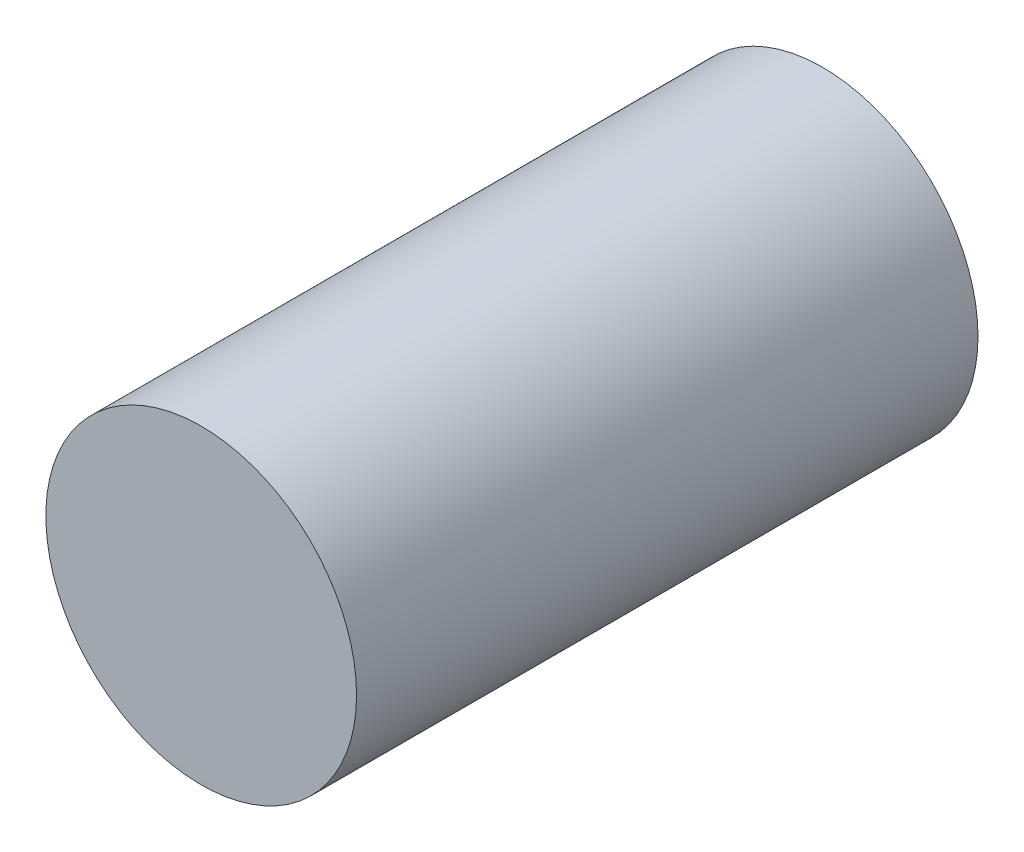
ISO-10303-21;
HEADER;
FILE_DESCRIPTION(('STEP AP214'),'2;1');
FILE_NAME('part.step','',(''),(''),'','','');
FILE_SCHEMA(('AUTOMOTIVE_DESIGN { 1 0 10303 214 1 1 1 1 }'));
ENDSEC;
DATA;
#1=APPLICATION_CONTEXT('core data for automotive mechanical design processes');
#2=APPLICATION_PROTOCOL_DEFINITION('international standard','automotive_design',2000,#1);
#3=PRODUCT_CONTEXT('',#1,'mechanical');
#4=PRODUCT('Part','Part','',(#3));
#5=PRODUCT_RELATED_PRODUCT_CATEGORY('part','',(#4));
#6=PRODUCT_DEFINITION_FORMATION('','',#4);
#7=PRODUCT_DEFINITION_CONTEXT('part definition',#1,'design');
#8=PRODUCT_DEFINITION('design','',#6,#7);
#9=PRODUCT_DEFINITION_SHAPE('','',#8);
#10=(LENGTH_UNIT() NAMED_UNIT(*) SI_UNIT(.MILLI.,.METRE.));
#11=(NAMED_UNIT(*) PLANE_ANGLE_UNIT() SI_UNIT($,.RADIAN.));
#12=(NAMED_UNIT(*) SI_UNIT($,.STERADIAN.) SOLID_ANGLE_UNIT());
#13=UNCERTAINTY_MEASURE_WITH_UNIT(LENGTH_MEASURE(1.E-05),#10,'distance_accuracy_value','');
#14=(GEOMETRIC_REPRESENTATION_CONTEXT(3) GLOBAL_UNCERTAINTY_ASSIGNED_CONTEXT((#13)) GLOBAL_UNIT_ASSIGNED_CONTEXT((#10,
#11,#12)) REPRESENTATION_CONTEXT('',''));
#15=CARTESIAN_POINT('',(0.,0.,0.));
#16=DIRECTION('',(0.,0.,1.));
#17=DIRECTION('',(1.,0.,0.));
#18=AXIS2_PLACEMENT_3D('',#15,#16,#17);
#19=CARTESIAN_POINT('',(0.,0.,0.));
#20=DIRECTION('',(0.,0.,1.));
#21=DIRECTION('',(1.,0.,0.));
#22=AXIS2_PLACEMENT_3D('',#19,#20,#21);
#23=PLANE('',#22);
#24=CARTESIAN_POINT('',(0.,0.,0.));
#25=DIRECTION('',(0.,0.,1.));
#26=DIRECTION('',(1.,0.,0.));
#27=AXIS2_PLACEMENT_3D('',#24,#25,#26);
#28=CIRCLE('',#27,10.);
#29=CARTESIAN_POINT('',(10.,0.,0.));
#30=VERTEX_POINT('',#29);
#31=EDGE_CURVE('E36',#30,#30,#28,.T.);
#32=ORIENTED_EDGE('',*,*,#31,.F.);
#33=EDGE_LOOP('',(#32));
#34=FACE_BOUND('',#33,.T.);
#35=CARTESIAN_POINT('',(0.,0.,0.));
#36=DIRECTION('',(0.,0.,-1.));
#37=DIRECTION('',(-1.,0.,0.));
#38=AXIS2_PLACEMENT_3D('',#35,#36,#37);
#39=CIRCLE('',#38,2.1);
#40=CARTESIAN_POINT('',(-2.1,0.,0.));
#41=VERTEX_POINT('',#40);
#42=EDGE_CURVE('E122',#41,#41,#39,.T.);
#43=ORIENTED_EDGE('',*,*,#42,.F.);
#44=EDGE_LOOP('',(#43));
#45=FACE_BOUND('',#44,.T.);
#46=ADVANCED_FACE('F32',(#34,#45),#23,.F.);
#47=CARTESIAN_POINT('',(0.,0.,40.));
#48=DIRECTION('',(0.,0.,-1.));
#49=DIRECTION('',(-1.,0.,0.));
#50=AXIS2_PLACEMENT_3D('',#47,#48,#49);
#51=CYLINDRICAL_SURFACE('',#50,10.);
#52=CARTESIAN_POINT('',(0.,0.,40.));
#53=DIRECTION('',(0.,0.,1.));
#54=DIRECTION('',(1.,0.,0.));
#55=AXIS2_PLACEMENT_3D('',#52,#53,#54);
#56=CIRCLE('',#55,10.);
#57=CARTESIAN_POINT('',(10.,0.,40.));
#58=VERTEX_POINT('',#57);
#59=EDGE_CURVE('E10',#58,#58,#56,.T.);
#60=ORIENTED_EDGE('',*,*,#59,.F.);
#61=EDGE_LOOP('',(#60));
#62=FACE_BOUND('',#61,.T.);
#63=ORIENTED_EDGE('',*,*,#31,.T.);
#64=EDGE_LOOP('',(#63));
#65=FACE_BOUND('',#64,.T.);
#66=ADVANCED_FACE('F34',(#62,#65),#51,.T.);
#67=CARTESIAN_POINT('',(0.,0.,40.));
#68=DIRECTION('',(0.,0.,1.));
#69=DIRECTION('',(1.,0.,0.));
#70=AXIS2_PLACEMENT_3D('',#67,#68,#69);
#71=PLANE('',#70);
#72=ORIENTED_EDGE('',*,*,#59,.T.);
#73=EDGE_LOOP('',(#72));
#74=FACE_BOUND('',#73,.T.);
#75=ADVANCED_FACE('F149',(#74),#71,.T.);
#76=CARTESIAN_POINT('',(0.,0.,20.));
#77=DIRECTION('',(0.,0.,-1.));
#78=DIRECTION('',(1.,0.,0.));
#79=AXIS2_PLACEMENT_3D('',#76,#77,#78);
#80=SPHERICAL_SURFACE('',#79,1.);
#81=CARTESIAN_POINT('',(0.,0.,20.));
#82=DIRECTION('',(0.,0.,-1.));
#83=DIRECTION('',(-1.,0.,0.));
#84=AXIS2_PLACEMENT_3D('',#81,#82,#83);
#85=CIRCLE('',#84,1.);
#86=CARTESIAN_POINT('',(-0.999999999999998,0.,20.));
#87=VERTEX_POINT('',#86);
#88=EDGE_CURVE('E195',#87,#87,#85,.T.);
#89=ORIENTED_EDGE('',*,*,#88,.T.);
#90=EDGE_LOOP('',(#89));
#91=FACE_BOUND('',#90,.T.);
#92=ADVANCED_FACE('F156',(#91),#80,.F.);
#93=CARTESIAN_POINT('',(1.,0.,20.));
#94=DIRECTION('',(0.,0.,-1.));
#95=DIRECTION('',(-1.,0.,0.));
#96=AXIS2_PLACEMENT_3D('',#93,#94,#95);
#97=PLANE('',#96);
#98=CARTESIAN_POINT('',(0.,0.,20.));
#99=DIRECTION('',(0.,0.,-1.));
#100=DIRECTION('',(-1.,0.,0.));
#101=AXIS2_PLACEMENT_3D('',#98,#99,#100);
#102=CIRCLE('',#101,1.6);
#103=CARTESIAN_POINT('',(-1.59999999999999,0.,20.));
#104=VERTEX_POINT('',#103);
#105=EDGE_CURVE('E194',#104,#104,#102,.T.);
#106=ORIENTED_EDGE('',*,*,#105,.T.);
#107=EDGE_LOOP('',(#106));
#108=FACE_BOUND('',#107,.T.);
#109=ORIENTED_EDGE('',*,*,#88,.F.);
#110=EDGE_LOOP('',(#109));
#111=FACE_BOUND('',#110,.T.);
#112=ADVANCED_FACE('F180',(#108,#111),#97,.T.);
#113=CARTESIAN_POINT('',(0.,0.,19.5));
#114=DIRECTION('',(0.,0.,-1.));
#115=DIRECTION('',(-1.,0.,0.));
#116=AXIS2_PLACEMENT_3D('',#113,#114,#115);
#117=TOROIDAL_SURFACE('',#116,1.6,0.5);
#118=CARTESIAN_POINT('',(0.,0.,19.5));
#119=DIRECTION('',(0.,0.,-1.));
#120=DIRECTION('',(-1.,0.,0.));
#121=AXIS2_PLACEMENT_3D('',#118,#119,#120);
#122=CIRCLE('',#121,2.1);
#123=CARTESIAN_POINT('',(-2.1,0.,19.5));
#124=VERTEX_POINT('',#123);
#125=EDGE_CURVE('E191',#124,#124,#122,.T.);
#126=ORIENTED_EDGE('',*,*,#125,.T.);
#127=EDGE_LOOP('',(#126));
#128=FACE_BOUND('',#127,.T.);
#129=ORIENTED_EDGE('',*,*,#105,.F.);
#130=EDGE_LOOP('',(#129));
#131=FACE_BOUND('',#130,.T.);
#132=ADVANCED_FACE('F140',(#128,#131),#117,.F.);
#133=CARTESIAN_POINT('',(0.,0.,0.));
#134=DIRECTION('',(0.,0.,-1.));
#135=DIRECTION('',(-1.,0.,0.));
#136=AXIS2_PLACEMENT_3D('',#133,#134,#135);
#137=CYLINDRICAL_SURFACE('',#136,2.1);
#138=CARTESIAN_POINT('',(2.1,0.,17.3649147038914));
#139=CARTESIAN_POINT('',(2.10000013534698,0.027017055860878,17.3649149600796));
#140=CARTESIAN_POINT('',(2.09947389495133,0.0540321101324284,17.362682637695));
#141=CARTESIAN_POINT('',(2.09742685160139,0.107287831584696,17.3538120437736));
#142=CARTESIAN_POINT('',(2.09590615334828,0.133528579984023,17.3471742360659));
#143=CARTESIAN_POINT('',(2.09203682808871,0.18448648880531,17.3296707766783));
#144=CARTESIAN_POINT('',(2.08968840637529,0.209204025232012,17.3188061732644));
#145=CARTESIAN_POINT('',(2.08441949205406,0.256438812860924,17.2931500051854));
#146=CARTESIAN_POINT('',(2.08149901159444,0.278956110771981,17.2783585239087));
#147=CARTESIAN_POINT('',(2.07537781948196,0.321356347266309,17.2451572676696));
#148=CARTESIAN_POINT('',(2.07217527613835,0.341219579433089,17.2267227015647));
#149=CARTESIAN_POINT('',(2.06584358018548,0.377668413517448,17.1868532793931));
#150=CARTESIAN_POINT('',(2.06271443313305,0.394253767968702,17.1654181970081));
#151=CARTESIAN_POINT('',(2.05673250454513,0.424377571104567,17.1193856937886));
#152=CARTESIAN_POINT('',(2.05389315252176,0.437789710924929,17.0947041064263));
#153=CARTESIAN_POINT('',(2.04888139395525,0.460676216341718,17.0435213855989));
#154=CARTESIAN_POINT('',(2.04670919882964,0.470149334024382,17.0170196785989));
#155=CARTESIAN_POINT('',(2.04305273215899,0.485804566358775,16.9606876323107));
#156=CARTESIAN_POINT('',(2.04163857678029,0.4916572949395,16.9307616842427));
#157=CARTESIAN_POINT('',(2.03985887629031,0.498988222050614,16.8703556441127));
#158=CARTESIAN_POINT('',(2.0394937643768,0.500464613400256,16.839875328354));
#159=CARTESIAN_POINT('',(2.03980213630231,0.499207905300174,16.7751434615067));
#160=CARTESIAN_POINT('',(2.04061309280366,0.495917675978645,16.7409034671232));
#161=CARTESIAN_POINT('',(2.0433749395959,0.484409692666076,16.6732919406647));
#162=CARTESIAN_POINT('',(2.04532693848286,0.476187146408207,16.6399212861905));
#163=CARTESIAN_POINT('',(2.05042096887334,0.453786505557304,16.5708804944482));
#164=CARTESIAN_POINT('',(2.05367699960968,0.439015988017871,16.5354094953734));
#165=CARTESIAN_POINT('',(2.06089886995536,0.403756472101969,16.4674983715523));
#166=CARTESIAN_POINT('',(2.06486431716248,0.38327063157673,16.4350565862673));
#167=CARTESIAN_POINT('',(2.07206297401813,0.341892415598979,16.381339196235));
#168=CARTESIAN_POINT('',(2.0752606449846,0.322124407818162,16.3591920737752));
#169=CARTESIAN_POINT('',(2.08146131694597,0.279259443097242,16.3183635594364));
#170=CARTESIAN_POINT('',(2.08446461777478,0.256167799619371,16.299676742612));
#171=CARTESIAN_POINT('',(2.08940704680269,0.21161201198237,16.2699426125728));
#172=CARTESIAN_POINT('',(2.09143987391839,0.1906789564952,16.2581179004268));
#173=CARTESIAN_POINT('',(2.0949544273795,0.147112038001286,16.2380376588472));
#174=CARTESIAN_POINT('',(2.09643651016618,0.124479286479745,16.2297798203719));
#175=CARTESIAN_POINT('',(2.09868433436348,0.0779092196004517,16.2173616516538));
#176=CARTESIAN_POINT('',(2.09944545237326,0.053964512305816,16.2132277585759));
#177=CARTESIAN_POINT('',(2.10013055186416,0.00571283440946134,16.2095033670869));
#178=CARTESIAN_POINT('',(2.10005487599663,-0.0185939838431242,16.2099110090032));
#179=CARTESIAN_POINT('',(2.09913048565165,-0.0641599620608657,16.2149447287968));
#180=CARTESIAN_POINT('',(2.09836341877521,-0.085472066102778,16.2191253176157));
#181=CARTESIAN_POINT('',(2.09625237617656,-0.127126929428396,16.2308085790678));
#182=CARTESIAN_POINT('',(2.09490832730107,-0.147469565433565,16.2383116729522));
#183=CARTESIAN_POINT('',(2.09170109037234,-0.187645926044247,16.256615365473));
#184=CARTESIAN_POINT('',(2.08981769869844,-0.207418083878495,16.267546288707));
#185=CARTESIAN_POINT('',(2.0857221477503,-0.245204266217452,16.2920555196805));
#186=CARTESIAN_POINT('',(2.08350974740615,-0.263216985383095,16.3056357709197));
#187=CARTESIAN_POINT('',(2.07784741190989,-0.305264170745397,16.3417717880896));
#188=CARTESIAN_POINT('',(2.07429909016047,-0.32822110846253,16.3655706029834));
#189=CARTESIAN_POINT('',(2.06726634480154,-0.369944883708084,16.4166038751656));
#190=CARTESIAN_POINT('',(2.06378203243842,-0.388704962517841,16.4438437652384));
#191=CARTESIAN_POINT('',(2.05718999426136,-0.422214024555051,16.5012290293635));
#192=CARTESIAN_POINT('',(2.05408811941643,-0.436904172795394,16.5314092683357));
#193=CARTESIAN_POINT('',(2.04862380073637,-0.461847686310285,16.5936016354477));
#194=CARTESIAN_POINT('',(2.04626134933996,-0.472101096954905,16.625613744851));
#195=CARTESIAN_POINT('',(2.04223391007568,-0.489256651354704,16.6959592864633));
#196=CARTESIAN_POINT('',(2.04073664696461,-0.495379951350422,16.734496123406));
#197=CARTESIAN_POINT('',(2.03935724630288,-0.501030518456208,16.8121113960749));
#198=CARTESIAN_POINT('',(2.03947551094671,-0.500556143038292,16.851189964249));
#199=CARTESIAN_POINT('',(2.04140263620674,-0.492637464185853,16.9272154609909));
#200=CARTESIAN_POINT('',(2.04315119144443,-0.485441768872913,16.9641887606865));
#201=CARTESIAN_POINT('',(2.04810935822317,-0.464077651127189,17.0359599772734));
#202=CARTESIAN_POINT('',(2.05131703919534,-0.449918440117606,17.0707606997278));
#203=CARTESIAN_POINT('',(2.05821647195102,-0.417111902889266,17.1319618207609));
#204=CARTESIAN_POINT('',(2.0617791558553,-0.399360809433088,17.1588576582524));
#205=CARTESIAN_POINT('',(2.06917746723406,-0.359056879331325,17.2087312468116));
#206=CARTESIAN_POINT('',(2.07301289316437,-0.336507564305008,17.231711849283));
#207=CARTESIAN_POINT('',(2.07998659418494,-0.290073077223846,17.2704852754232));
#208=CARTESIAN_POINT('',(2.08315478044131,-0.266622656068281,17.28679558492));
#209=CARTESIAN_POINT('',(2.08888978435223,-0.217158441562158,17.3150546143603));
#210=CARTESIAN_POINT('',(2.09145673714156,-0.191145226102805,17.3270043147432));
#211=CARTESIAN_POINT('',(2.09562605959526,-0.138002269492191,17.3459414886457));
#212=CARTESIAN_POINT('',(2.09724990625089,-0.110913763757642,17.3530401584525));
#213=CARTESIAN_POINT('',(2.09943675443007,-0.0558827357357489,17.3625264025123));
#214=CARTESIAN_POINT('',(2.09999986002788,-0.0279402975051125,17.3649144389486));
#215=CARTESIAN_POINT('',(2.1,0.,17.3649147038914));
#216=B_SPLINE_CURVE_WITH_KNOTS('',3,(#138,#139,#140,#141,#142,#143,#144,#145,#146,#147,#148,
#149,#150,#151,#152,#153,#154,#155,#156,#157,#158,#159,#160,#161,#162,#163,#164,#165,#166,#167,
#168,#169,#170,#171,#172,#173,#174,#175,#176,#177,#178,#179,#180,#181,#182,#183,#184,#185,#186,
#187,#188,#189,#190,#191,#192,#193,#194,#195,#196,#197,#198,#199,#200,#201,#202,#203,#204,#205,
#206,#207,#208,#209,#210,#211,#212,#213,#214,#215),.UNSPECIFIED.,.T.,.F.,(4,2,2,2,2,2,2,2,2,2,2,
2,2,2,2,2,2,2,2,2,2,2,2,2,2,2,2,2,2,2,2,2,2,2,2,2,2,2,4),(0.,0.0809513147617396,
0.161894107962196,0.242816839736661,0.323737853229647,0.405229771528625,0.486727839785084,
0.571065745582884,0.65543034998486,0.746640052437058,0.8378874141149,0.940697549231841,
1.04360773741856,1.15876815470816,1.27386506872745,1.36311542747417,1.45222465555411,
1.52431978495742,1.59636817284893,1.66887552542984,1.74135318871533,1.80625338360562,
1.87116180936932,1.93892030973858,2.00672870472029,2.10595927272778,2.20534851162708,
2.30610732916013,2.40686511630929,2.52344124026564,2.64004638701576,2.75250243039194,
2.86481011405142,2.96152283588183,3.05816481945481,3.14394850071505,3.22971288247062,
3.31343872510083,3.39715635257008),.UNSPECIFIED.);
#217=CARTESIAN_POINT('',(2.1,0.,17.3649147038914));
#218=VERTEX_POINT('',#217);
#219=EDGE_CURVE('E63',#218,#218,#216,.T.);
#220=ORIENTED_EDGE('',*,*,#219,.F.);
#221=EDGE_LOOP('',(#220));
#222=FACE_BOUND('',#221,.T.);
#223=CARTESIAN_POINT('',(0.,-2.1,17.3649147038915));
#224=CARTESIAN_POINT('',(0.0270170558608727,-2.10000013534698,17.3649149600796));
#225=CARTESIAN_POINT('',(0.0540321101324228,-2.09947389495133,17.362682637695));
#226=CARTESIAN_POINT('',(0.10728783158469,-2.09742685160139,17.3538120437736));
#227=CARTESIAN_POINT('',(0.133528579984018,-2.09590615334828,17.3471742360659));
#228=CARTESIAN_POINT('',(0.184486488805306,-2.09203682808871,17.3296707766783));
#229=CARTESIAN_POINT('',(0.209204025232009,-2.08968840637528,17.3188061732644));
#230=CARTESIAN_POINT('',(0.256438812860921,-2.08441949205406,17.2931500051854));
#231=CARTESIAN_POINT('',(0.278956110771977,-2.08149901159444,17.2783585239087));
#232=CARTESIAN_POINT('',(0.321356347266305,-2.07537781948196,17.2451572676696));
#233=CARTESIAN_POINT('',(0.341219579433084,-2.07217527613834,17.2267227015647));
#234=CARTESIAN_POINT('',(0.377668413517443,-2.06584358018548,17.186853279393));
#235=CARTESIAN_POINT('',(0.394253767968698,-2.06271443313305,17.1654181970081));
#236=CARTESIAN_POINT('',(0.424377571104564,-2.05673250454513,17.1193856937886));
#237=CARTESIAN_POINT('',(0.437789710924925,-2.05389315252176,17.0947041064263));
#238=CARTESIAN_POINT('',(0.460676216341713,-2.04888139395525,17.0435213855989));
#239=CARTESIAN_POINT('',(0.470149334024377,-2.04670919882964,17.0170196785989));
#240=CARTESIAN_POINT('',(0.48580456635877,-2.04305273215899,16.9606876323107));
#241=CARTESIAN_POINT('',(0.491657294939495,-2.04163857678029,16.9307616842427));
#242=CARTESIAN_POINT('',(0.498988222050609,-2.03985887629031,16.8703556441127));
#243=CARTESIAN_POINT('',(0.500464613400251,-2.0394937643768,16.839875328354));
#244=CARTESIAN_POINT('',(0.499207905300169,-2.03980213630231,16.7751434615067));
#245=CARTESIAN_POINT('',(0.495917675978639,-2.04061309280366,16.7409034671232));
#246=CARTESIAN_POINT('',(0.48440969266607,-2.0433749395959,16.6732919406647));
#247=CARTESIAN_POINT('',(0.476187146408202,-2.04532693848286,16.6399212861905));
#248=CARTESIAN_POINT('',(0.453786505557298,-2.05042096887334,16.5708804944482));
#249=CARTESIAN_POINT('',(0.439015988017866,-2.05367699960968,16.5354094953734));
#250=CARTESIAN_POINT('',(0.403756472101964,-2.06089886995536,16.4674983715523));
#251=CARTESIAN_POINT('',(0.383270631576725,-2.06486431716248,16.4350565862673));
#252=CARTESIAN_POINT('',(0.341892415598975,-2.07206297401812,16.381339196235));
#253=CARTESIAN_POINT('',(0.322124407818159,-2.0752606449846,16.3591920737752));
#254=CARTESIAN_POINT('',(0.279259443097241,-2.08146131694597,16.3183635594364));
#255=CARTESIAN_POINT('',(0.25616779961937,-2.08446461777478,16.299676742612));
#256=CARTESIAN_POINT('',(0.211612011982369,-2.08940704680268,16.2699426125728));
#257=CARTESIAN_POINT('',(0.1906789564952,-2.09143987391839,16.2581179004268));
#258=CARTESIAN_POINT('',(0.147112038001287,-2.09495442737949,16.2380376588472));
#259=CARTESIAN_POINT('',(0.124479286479746,-2.09643651016618,16.2297798203719));
#260=CARTESIAN_POINT('',(0.0779092196004533,-2.09868433436348,16.2173616516538));
#261=CARTESIAN_POINT('',(0.0539645123058175,-2.09944545237325,16.2132277585759));
#262=CARTESIAN_POINT('',(0.00571283440946252,-2.10013055186416,16.2095033670869));
#263=CARTESIAN_POINT('',(-0.0185939838431233,-2.10005487599662,16.2099110090032));
#264=CARTESIAN_POINT('',(-0.0641599620608655,-2.09913048565165,16.2149447287968));
#265=CARTESIAN_POINT('',(-0.0854720661027782,-2.09836341877521,16.2191253176157));
#266=CARTESIAN_POINT('',(-0.127126929428396,-2.09625237617656,16.2308085790678));
#267=CARTESIAN_POINT('',(-0.147469565433565,-2.09490832730106,16.2383116729522));
#268=CARTESIAN_POINT('',(-0.187645926044247,-2.09170109037234,16.256615365473));
#269=CARTESIAN_POINT('',(-0.207418083878496,-2.08981769869844,16.267546288707));
#270=CARTESIAN_POINT('',(-0.245204266217453,-2.0857221477503,16.2920555196805));
#271=CARTESIAN_POINT('',(-0.263216985383096,-2.08350974740615,16.3056357709197));
#272=CARTESIAN_POINT('',(-0.305264170745399,-2.07784741190989,16.3417717880896));
#273=CARTESIAN_POINT('',(-0.328221108462533,-2.07429909016047,16.3655706029834));
#274=CARTESIAN_POINT('',(-0.369944883708088,-2.06726634480154,16.4166038751656));
#275=CARTESIAN_POINT('',(-0.388704962517844,-2.06378203243842,16.4438437652384));
#276=CARTESIAN_POINT('',(-0.422214024555054,-2.05718999426136,16.5012290293635));
#277=CARTESIAN_POINT('',(-0.436904172795397,-2.05408811941643,16.5314092683357));
#278=CARTESIAN_POINT('',(-0.461847686310288,-2.04862380073636,16.5936016354477));
#279=CARTESIAN_POINT('',(-0.472101096954908,-2.04626134933996,16.625613744851));
#280=CARTESIAN_POINT('',(-0.489256651354708,-2.04223391007567,16.6959592864633));
#281=CARTESIAN_POINT('',(-0.495379951350426,-2.0407366469646,16.734496123406));
#282=CARTESIAN_POINT('',(-0.501030518456213,-2.03935724630288,16.8121113960749));
#283=CARTESIAN_POINT('',(-0.500556143038297,-2.03947551094671,16.851189964249));
#284=CARTESIAN_POINT('',(-0.492637464185859,-2.04140263620674,16.9272154609909));
#285=CARTESIAN_POINT('',(-0.48544176887292,-2.04315119144442,16.9641887606865));
#286=CARTESIAN_POINT('',(-0.464077651127197,-2.04810935822316,17.0359599772734));
#287=CARTESIAN_POINT('',(-0.449918440117614,-2.05131703919534,17.0707606997278));
#288=CARTESIAN_POINT('',(-0.417111902889275,-2.05821647195102,17.1319618207609));
#289=CARTESIAN_POINT('',(-0.399360809433098,-2.06177915585529,17.1588576582524));
#290=CARTESIAN_POINT('',(-0.359056879331336,-2.06917746723405,17.2087312468116));
#291=CARTESIAN_POINT('',(-0.336507564305019,-2.07301289316437,17.231711849283));
#292=CARTESIAN_POINT('',(-0.290073077223858,-2.07998659418494,17.2704852754232));
#293=CARTESIAN_POINT('',(-0.266622656068293,-2.08315478044131,17.28679558492));
#294=CARTESIAN_POINT('',(-0.217158441562169,-2.08888978435222,17.3150546143603));
#295=CARTESIAN_POINT('',(-0.191145226102815,-2.09145673714156,17.3270043147432));
#296=CARTESIAN_POINT('',(-0.1380022694922,-2.09562605959526,17.3459414886457));
#297=CARTESIAN_POINT('',(-0.11091376375765,-2.09724990625089,17.3530401584525));
#298=CARTESIAN_POINT('',(-0.0558827357357555,-2.09943675443007,17.3625264025123));
#299=CARTESIAN_POINT('',(-0.0279402975051184,-2.09999986002787,17.3649144389487));
#300=CARTESIAN_POINT('',(0.,-2.1,17.3649147038915));
#301=B_SPLINE_CURVE_WITH_KNOTS('',3,(#223,#224,#225,#226,#227,#228,#229,#230,#231,#232,#233,
#234,#235,#236,#237,#238,#239,#240,#241,#242,#243,#244,#245,#246,#247,#248,#249,#250,#251,#252,
#253,#254,#255,#256,#257,#258,#259,#260,#261,#262,#263,#264,#265,#266,#267,#268,#269,#270,#271,
#272,#273,#274,#275,#276,#277,#278,#279,#280,#281,#282,#283,#284,#285,#286,#287,#288,#289,#290,
#291,#292,#293,#294,#295,#296,#297,#298,#299,#300),.UNSPECIFIED.,.T.,.F.,(4,2,2,2,2,2,2,2,2,2,2,
2,2,2,2,2,2,2,2,2,2,2,2,2,2,2,2,2,2,2,2,2,2,2,2,2,2,2,4),(0.,0.0809513147617394,
0.161894107962197,0.242816839736665,0.323737853229649,0.405229771528627,0.486727839785087,
0.571065745582887,0.655430349984859,0.746640052437057,0.837887414114898,0.94069754923184,
1.04360773741857,1.15876815470816,1.27386506872745,1.36311542747416,1.4522246555541,
1.52431978495741,1.59636817284892,1.66887552542983,1.74135318871532,1.80625338360562,
1.87116180936932,1.93892030973858,2.00672870472029,2.10595927272778,2.20534851162707,
2.30610732916012,2.40686511630928,2.52344124026564,2.64004638701575,2.75250243039193,
2.86481011405141,2.96152283588183,3.0581648194548,3.14394850071504,3.22971288247061,
3.31343872510082,3.39715635257008),.UNSPECIFIED.);
#302=CARTESIAN_POINT('',(0.,-2.1,17.3649147038915));
#303=VERTEX_POINT('',#302);
#304=EDGE_CURVE('E70',#303,#303,#301,.T.);
#305=ORIENTED_EDGE('',*,*,#304,.F.);
#306=EDGE_LOOP('',(#305));
#307=FACE_BOUND('',#306,.T.);
#308=CARTESIAN_POINT('',(-2.1,0.,17.3649147038915));
#309=CARTESIAN_POINT('',(-2.10000013534698,-0.0270170558608539,17.3649149600796));
#310=CARTESIAN_POINT('',(-2.09947389495132,-0.0540321101324041,17.362682637695));
#311=CARTESIAN_POINT('',(-2.09742685160139,-0.107287831584672,17.3538120437736));
#312=CARTESIAN_POINT('',(-2.09590615334828,-0.133528579983999,17.3471742360659));
#313=CARTESIAN_POINT('',(-2.09203682808871,-0.184486488805287,17.3296707766783));
#314=CARTESIAN_POINT('',(-2.08968840637528,-0.20920402523199,17.3188061732644));
#315=CARTESIAN_POINT('',(-2.08441949205406,-0.256438812860902,17.2931500051854));
#316=CARTESIAN_POINT('',(-2.08149901159444,-0.278956110771958,17.2783585239087));
#317=CARTESIAN_POINT('',(-2.07537781948196,-0.321356347266287,17.2451572676696));
#318=CARTESIAN_POINT('',(-2.07217527613834,-0.341219579433068,17.2267227015647));
#319=CARTESIAN_POINT('',(-2.06584358018548,-0.377668413517428,17.1868532793931));
#320=CARTESIAN_POINT('',(-2.06271443313305,-0.394253767968682,17.1654181970081));
#321=CARTESIAN_POINT('',(-2.05673250454513,-0.424377571104548,17.1193856937886));
#322=CARTESIAN_POINT('',(-2.05389315252176,-0.43778971092491,17.0947041064263));
#323=CARTESIAN_POINT('',(-2.04888139395525,-0.4606762163417,17.0435213855989));
#324=CARTESIAN_POINT('',(-2.04670919882964,-0.470149334024364,17.0170196785989));
#325=CARTESIAN_POINT('',(-2.04305273215899,-0.485804566358758,16.9606876323107));
#326=CARTESIAN_POINT('',(-2.04163857678029,-0.491657294939484,16.9307616842427));
#327=CARTESIAN_POINT('',(-2.03985887629031,-0.498988222050599,16.8703556441128));
#328=CARTESIAN_POINT('',(-2.0394937643768,-0.500464613400241,16.839875328354));
#329=CARTESIAN_POINT('',(-2.03980213630231,-0.499207905300161,16.7751434615067));
#330=CARTESIAN_POINT('',(-2.04061309280366,-0.495917675978632,16.7409034671232));
#331=CARTESIAN_POINT('',(-2.0433749395959,-0.484409692666064,16.6732919406647));
#332=CARTESIAN_POINT('',(-2.04532693848286,-0.476187146408196,16.6399212861905));
#333=CARTESIAN_POINT('',(-2.05042096887334,-0.453786505557293,16.5708804944482));
#334=CARTESIAN_POINT('',(-2.05367699960968,-0.439015988017861,16.5354094953734));
#335=CARTESIAN_POINT('',(-2.06089886995535,-0.40375647210196,16.4674983715523));
#336=CARTESIAN_POINT('',(-2.06486431716247,-0.383270631576723,16.4350565862673));
#337=CARTESIAN_POINT('',(-2.07206297401812,-0.341892415598974,16.381339196235));
#338=CARTESIAN_POINT('',(-2.07526064498459,-0.322124407818158,16.3591920737752));
#339=CARTESIAN_POINT('',(-2.08146131694597,-0.279259443097239,16.3183635594364));
#340=CARTESIAN_POINT('',(-2.08446461777477,-0.256167799619368,16.299676742612));
#341=CARTESIAN_POINT('',(-2.08940704680268,-0.211612011982367,16.2699426125728));
#342=CARTESIAN_POINT('',(-2.09143987391839,-0.190678956495198,16.2581179004268));
#343=CARTESIAN_POINT('',(-2.09495442737949,-0.147112038001286,16.2380376588472));
#344=CARTESIAN_POINT('',(-2.09643651016617,-0.124479286479744,16.229779820372));
#345=CARTESIAN_POINT('',(-2.09868433436347,-0.0779092196004506,16.2173616516538));
#346=CARTESIAN_POINT('',(-2.09944545237325,-0.0539645123058151,16.2132277585759));
#347=CARTESIAN_POINT('',(-2.10013055186416,-0.00571283440946044,16.2095033670869));
#348=CARTESIAN_POINT('',(-2.10005487599662,0.0185939838431254,16.2099110090032));
#349=CARTESIAN_POINT('',(-2.09913048565164,0.0641599620608674,16.2149447287968));
#350=CARTESIAN_POINT('',(-2.09836341877521,0.0854720661027801,16.2191253176157));
#351=CARTESIAN_POINT('',(-2.09625237617656,0.127126929428398,16.2308085790678));
#352=CARTESIAN_POINT('',(-2.09490832730106,0.147469565433568,16.2383116729522));
#353=CARTESIAN_POINT('',(-2.09170109037234,0.18764592604425,16.256615365473));
#354=CARTESIAN_POINT('',(-2.08981769869844,0.207418083878499,16.267546288707));
#355=CARTESIAN_POINT('',(-2.0857221477503,0.245204266217456,16.2920555196805));
#356=CARTESIAN_POINT('',(-2.08350974740615,0.263216985383099,16.3056357709197));
#357=CARTESIAN_POINT('',(-2.07784741190988,0.305264170745401,16.3417717880896));
#358=CARTESIAN_POINT('',(-2.07429909016047,0.328221108462534,16.3655706029834));
#359=CARTESIAN_POINT('',(-2.06726634480153,0.369944883708089,16.4166038751656));
#360=CARTESIAN_POINT('',(-2.06378203243841,0.388704962517847,16.4438437652384));
#361=CARTESIAN_POINT('',(-2.05718999426136,0.422214024555058,16.5012290293635));
#362=CARTESIAN_POINT('',(-2.05408811941642,0.436904172795403,16.5314092683357));
#363=CARTESIAN_POINT('',(-2.04862380073636,0.461847686310294,16.5936016354477));
#364=CARTESIAN_POINT('',(-2.04626134933996,0.472101096954914,16.625613744851));
#365=CARTESIAN_POINT('',(-2.04223391007567,0.489256651354714,16.6959592864633));
#366=CARTESIAN_POINT('',(-2.0407366469646,0.495379951350433,16.734496123406));
#367=CARTESIAN_POINT('',(-2.03935724630287,0.501030518456222,16.8121113960749));
#368=CARTESIAN_POINT('',(-2.0394755109467,0.500556143038307,16.851189964249));
#369=CARTESIAN_POINT('',(-2.04140263620673,0.492637464185871,16.9272154609908));
#370=CARTESIAN_POINT('',(-2.04315119144442,0.485441768872932,16.9641887606865));
#371=CARTESIAN_POINT('',(-2.04810935822316,0.464077651127211,17.0359599772734));
#372=CARTESIAN_POINT('',(-2.05131703919533,0.449918440117629,17.0707606997278));
#373=CARTESIAN_POINT('',(-2.05821647195101,0.417111902889291,17.1319618207609));
#374=CARTESIAN_POINT('',(-2.06177915585529,0.399360809433113,17.1588576582524));
#375=CARTESIAN_POINT('',(-2.06917746723405,0.359056879331351,17.2087312468116));
#376=CARTESIAN_POINT('',(-2.07301289316436,0.336507564305035,17.231711849283));
#377=CARTESIAN_POINT('',(-2.07998659418493,0.290073077223872,17.2704852754232));
#378=CARTESIAN_POINT('',(-2.08315478044131,0.266622656068307,17.28679558492));
#379=CARTESIAN_POINT('',(-2.08888978435222,0.217158441562185,17.3150546143603));
#380=CARTESIAN_POINT('',(-2.09145673714155,0.191145226102832,17.3270043147432));
#381=CARTESIAN_POINT('',(-2.09562605959525,0.138002269492218,17.3459414886457));
#382=CARTESIAN_POINT('',(-2.09724990625089,0.110913763757669,17.3530401584525));
#383=CARTESIAN_POINT('',(-2.09943675443007,0.0558827357357744,17.3625264025123));
#384=CARTESIAN_POINT('',(-2.09999986002787,0.0279402975051374,17.3649144389487));
#385=CARTESIAN_POINT('',(-2.1,0.,17.3649147038915));
#386=B_SPLINE_CURVE_WITH_KNOTS('',3,(#308,#309,#310,#311,#312,#313,#314,#315,#316,#317,#318,
#319,#320,#321,#322,#323,#324,#325,#326,#327,#328,#329,#330,#331,#332,#333,#334,#335,#336,#337,
#338,#339,#340,#341,#342,#343,#344,#345,#346,#347,#348,#349,#350,#351,#352,#353,#354,#355,#356,
#357,#358,#359,#360,#361,#362,#363,#364,#365,#366,#367,#368,#369,#370,#371,#372,#373,#374,#375,
#376,#377,#378,#379,#380,#381,#382,#383,#384,#385),.UNSPECIFIED.,.T.,.F.,(4,2,2,2,2,2,2,2,2,2,2,
2,2,2,2,2,2,2,2,2,2,2,2,2,2,2,2,2,2,2,2,2,2,2,2,2,2,2,4),(0.,0.0809513147617394,
0.161894107962197,0.242816839736663,0.323737853229648,0.405229771528625,0.486727839785085,
0.571065745582885,0.655430349984859,0.746640052437057,0.837887414114895,0.94069754923184,
1.04360773741856,1.15876815470816,1.27386506872745,1.36311542747416,1.4522246555541,
1.52431978495741,1.59636817284892,1.66887552542983,1.74135318871532,1.80625338360562,
1.87116180936932,1.93892030973858,2.00672870472029,2.10595927272777,2.20534851162707,
2.30610732916012,2.40686511630928,2.52344124026563,2.64004638701575,2.75250243039193,
2.86481011405141,2.96152283588183,3.05816481945481,3.14394850071504,3.22971288247062,
3.31343872510083,3.39715635257008),.UNSPECIFIED.);
#387=CARTESIAN_POINT('',(-2.1,0.,17.3649147038915));
#388=VERTEX_POINT('',#387);
#389=EDGE_CURVE('E106',#388,#388,#386,.T.);
#390=ORIENTED_EDGE('',*,*,#389,.F.);
#391=EDGE_LOOP('',(#390));
#392=FACE_BOUND('',#391,.T.);
#393=CARTESIAN_POINT('',(0.,2.1,17.3649147038915));
#394=CARTESIAN_POINT('',(-0.0270170558608538,2.10000013534698,17.3649149600796));
#395=CARTESIAN_POINT('',(-0.0540321101324039,2.09947389495132,17.362682637695));
#396=CARTESIAN_POINT('',(-0.107287831584671,2.09742685160139,17.3538120437736));
#397=CARTESIAN_POINT('',(-0.133528579983999,2.09590615334828,17.3471742360659));
#398=CARTESIAN_POINT('',(-0.184486488805287,2.09203682808871,17.3296707766783));
#399=CARTESIAN_POINT('',(-0.209204025231991,2.08968840637528,17.3188061732644));
#400=CARTESIAN_POINT('',(-0.256438812860902,2.08441949205406,17.2931500051854));
#401=CARTESIAN_POINT('',(-0.278956110771958,2.08149901159444,17.2783585239087));
#402=CARTESIAN_POINT('',(-0.321356347266286,2.07537781948197,17.2451572676696));
#403=CARTESIAN_POINT('',(-0.341219579433066,2.07217527613835,17.2267227015647));
#404=CARTESIAN_POINT('',(-0.377668413517426,2.06584358018548,17.1868532793931));
#405=CARTESIAN_POINT('',(-0.394253767968679,2.06271443313305,17.1654181970081));
#406=CARTESIAN_POINT('',(-0.424377571104545,2.05673250454513,17.1193856937886));
#407=CARTESIAN_POINT('',(-0.437789710924906,2.05389315252176,17.0947041064263));
#408=CARTESIAN_POINT('',(-0.460676216341695,2.04888139395525,17.0435213855989));
#409=CARTESIAN_POINT('',(-0.470149334024359,2.04670919882964,17.0170196785989));
#410=CARTESIAN_POINT('',(-0.485804566358751,2.043052732159,16.9606876323107));
#411=CARTESIAN_POINT('',(-0.491657294939477,2.04163857678029,16.9307616842427));
#412=CARTESIAN_POINT('',(-0.498988222050591,2.03985887629031,16.8703556441127));
#413=CARTESIAN_POINT('',(-0.500464613400232,2.0394937643768,16.839875328354));
#414=CARTESIAN_POINT('',(-0.49920790530015,2.03980213630231,16.7751434615067));
#415=CARTESIAN_POINT('',(-0.495917675978621,2.04061309280367,16.7409034671232));
#416=CARTESIAN_POINT('',(-0.484409692666052,2.04337493959591,16.6732919406647));
#417=CARTESIAN_POINT('',(-0.476187146408184,2.04532693848287,16.6399212861905));
#418=CARTESIAN_POINT('',(-0.453786505557281,2.05042096887335,16.5708804944482));
#419=CARTESIAN_POINT('',(-0.439015988017849,2.05367699960968,16.5354094953734));
#420=CARTESIAN_POINT('',(-0.403756472101947,2.06089886995536,16.4674983715523));
#421=CARTESIAN_POINT('',(-0.383270631576707,2.06486431716248,16.4350565862673));
#422=CARTESIAN_POINT('',(-0.341892415598956,2.07206297401813,16.381339196235));
#423=CARTESIAN_POINT('',(-0.32212440781814,2.0752606449846,16.3591920737752));
#424=CARTESIAN_POINT('',(-0.279259443097221,2.08146131694597,16.3183635594364));
#425=CARTESIAN_POINT('',(-0.25616779961935,2.08446461777478,16.299676742612));
#426=CARTESIAN_POINT('',(-0.211612011982348,2.08940704680269,16.2699426125728));
#427=CARTESIAN_POINT('',(-0.190678956495178,2.09143987391839,16.2581179004268));
#428=CARTESIAN_POINT('',(-0.147112038001265,2.09495442737949,16.2380376588472));
#429=CARTESIAN_POINT('',(-0.124479286479724,2.09643651016618,16.2297798203719));
#430=CARTESIAN_POINT('',(-0.0779092196004302,2.09868433436348,16.2173616516538));
#431=CARTESIAN_POINT('',(-0.0539645123057945,2.09944545237325,16.2132277585759));
#432=CARTESIAN_POINT('',(-0.00571283440943987,2.10013055186416,16.2095033670869));
#433=CARTESIAN_POINT('',(0.0185939838431456,2.10005487599662,16.2099110090032));
#434=CARTESIAN_POINT('',(0.0641599620608874,2.09913048565165,16.2149447287968));
#435=CARTESIAN_POINT('',(0.0854720661028,2.09836341877521,16.2191253176157));
#436=CARTESIAN_POINT('',(0.127126929428418,2.09625237617656,16.2308085790678));
#437=CARTESIAN_POINT('',(0.147469565433587,2.09490832730106,16.2383116729522));
#438=CARTESIAN_POINT('',(0.187645926044269,2.09170109037234,16.256615365473));
#439=CARTESIAN_POINT('',(0.207418083878518,2.08981769869844,16.267546288707));
#440=CARTESIAN_POINT('',(0.245204266217475,2.0857221477503,16.2920555196805));
#441=CARTESIAN_POINT('',(0.263216985383119,2.08350974740615,16.3056357709197));
#442=CARTESIAN_POINT('',(0.30526417074542,2.07784741190989,16.3417717880896));
#443=CARTESIAN_POINT('',(0.328221108462551,2.07429909016047,16.3655706029834));
#444=CARTESIAN_POINT('',(0.369944883708106,2.06726634480153,16.4166038751656));
#445=CARTESIAN_POINT('',(0.388704962517864,2.06378203243841,16.4438437652384));
#446=CARTESIAN_POINT('',(0.422214024555076,2.05718999426136,16.5012290293635));
#447=CARTESIAN_POINT('',(0.43690417279542,2.05408811941642,16.5314092683357));
#448=CARTESIAN_POINT('',(0.46184768631031,2.04862380073636,16.5936016354477));
#449=CARTESIAN_POINT('',(0.472101096954929,2.04626134933996,16.625613744851));
#450=CARTESIAN_POINT('',(0.489256651354728,2.04223391007567,16.6959592864633));
#451=CARTESIAN_POINT('',(0.495379951350445,2.0407366469646,16.734496123406));
#452=CARTESIAN_POINT('',(0.501030518456232,2.03935724630287,16.8121113960749));
#453=CARTESIAN_POINT('',(0.500556143038315,2.0394755109467,16.851189964249));
#454=CARTESIAN_POINT('',(0.492637464185876,2.04140263620674,16.9272154609909));
#455=CARTESIAN_POINT('',(0.485441768872936,2.04315119144442,16.9641887606865));
#456=CARTESIAN_POINT('',(0.464077651127213,2.04810935822316,17.0359599772734));
#457=CARTESIAN_POINT('',(0.449918440117629,2.05131703919534,17.0707606997278));
#458=CARTESIAN_POINT('',(0.41711190288929,2.05821647195101,17.1319618207609));
#459=CARTESIAN_POINT('',(0.399360809433112,2.06177915585529,17.1588576582524));
#460=CARTESIAN_POINT('',(0.359056879331348,2.06917746723405,17.2087312468116));
#461=CARTESIAN_POINT('',(0.336507564305032,2.07301289316436,17.231711849283));
#462=CARTESIAN_POINT('',(0.290073077223869,2.07998659418494,17.2704852754232));
#463=CARTESIAN_POINT('',(0.266622656068304,2.08315478044131,17.28679558492));
#464=CARTESIAN_POINT('',(0.217158441562181,2.08888978435222,17.3150546143603));
#465=CARTESIAN_POINT('',(0.191145226102828,2.09145673714156,17.3270043147432));
#466=CARTESIAN_POINT('',(0.138002269492215,2.09562605959526,17.3459414886457));
#467=CARTESIAN_POINT('',(0.110913763757665,2.09724990625089,17.3530401584525));
#468=CARTESIAN_POINT('',(0.0558827357357725,2.09943675443007,17.3625264025123));
#469=CARTESIAN_POINT('',(0.0279402975051364,2.09999986002787,17.3649144389487));
#470=CARTESIAN_POINT('',(0.,2.1,17.3649147038915));
#471=B_SPLINE_CURVE_WITH_KNOTS('',3,(#393,#394,#395,#396,#397,#398,#399,#400,#401,#402,#403,
#404,#405,#406,#407,#408,#409,#410,#411,#412,#413,#414,#415,#416,#417,#418,#419,#420,#421,#422,
#423,#424,#425,#426,#427,#428,#429,#430,#431,#432,#433,#434,#435,#436,#437,#438,#439,#440,#441,
#442,#443,#444,#445,#446,#447,#448,#449,#450,#451,#452,#453,#454,#455,#456,#457,#458,#459,#460,
#461,#462,#463,#464,#465,#466,#467,#468,#469,#470),.UNSPECIFIED.,.T.,.F.,(4,2,2,2,2,2,2,2,2,2,2,
2,2,2,2,2,2,2,2,2,2,2,2,2,2,2,2,2,2,2,2,2,2,2,2,2,2,2,4),(0.,0.0809513147617395,
0.161894107962197,0.242816839736665,0.323737853229649,0.405229771528625,0.486727839785088,
0.571065745582887,0.655430349984859,0.746640052437057,0.837887414114899,0.940697549231841,
1.04360773741856,1.15876815470816,1.27386506872745,1.36311542747416,1.4522246555541,
1.52431978495741,1.59636817284893,1.66887552542983,1.74135318871532,1.80625338360562,
1.87116180936932,1.93892030973858,2.00672870472029,2.10595927272777,2.20534851162708,
2.30610732916013,2.40686511630929,2.52344124026564,2.64004638701576,2.75250243039194,
2.86481011405142,2.96152283588183,3.05816481945481,3.14394850071505,3.22971288247062,
3.31343872510083,3.39715635257008),.UNSPECIFIED.);
#472=CARTESIAN_POINT('',(0.,2.1,17.3649147038915));
#473=VERTEX_POINT('',#472);
#474=EDGE_CURVE('E111',#473,#473,#471,.T.);
#475=ORIENTED_EDGE('',*,*,#474,.F.);
#476=EDGE_LOOP('',(#475));
#477=FACE_BOUND('',#476,.T.);
#478=CARTESIAN_POINT('',(0.,0.,8.));
#479=DIRECTION('',(0.,0.,1.));
#480=DIRECTION('',(1.,0.,0.));
#481=AXIS2_PLACEMENT_3D('',#478,#479,#480);
#482=CIRCLE('',#481,2.1);
#483=CARTESIAN_POINT('',(2.1,0.,8.));
#484=VERTEX_POINT('',#483);
#485=EDGE_CURVE('E198',#484,#484,#482,.T.);
#486=ORIENTED_EDGE('',*,*,#485,.F.);
#487=EDGE_LOOP('',(#486));
#488=FACE_BOUND('',#487,.T.);
#489=ORIENTED_EDGE('',*,*,#125,.F.);
#490=EDGE_LOOP('',(#489));
#491=FACE_BOUND('',#490,.T.);
#492=ADVANCED_FACE('F75',(#222,#307,#392,#477,#488,#491),#137,.F.);
#493=CARTESIAN_POINT('',(0.,0.,0.));
#494=DIRECTION('',(0.,0.,-1.));
#495=DIRECTION('',(-1.,0.,0.));
#496=AXIS2_PLACEMENT_3D('',#493,#494,#495);
#497=CYLINDRICAL_SURFACE('',#496,1.6);
#498=CARTESIAN_POINT('',(0.,0.,5.5));
#499=DIRECTION('',(0.,0.,-1.));
#500=DIRECTION('',(-1.,0.,0.));
#501=AXIS2_PLACEMENT_3D('',#498,#499,#500);
#502=CIRCLE('',#501,1.6);
#503=CARTESIAN_POINT('',(-1.6,0.,5.5));
#504=VERTEX_POINT('',#503);
#505=EDGE_CURVE('E211',#504,#504,#502,.T.);
#506=ORIENTED_EDGE('',*,*,#505,.T.);
#507=EDGE_LOOP('',(#506));
#508=FACE_BOUND('',#507,.T.);
#509=CARTESIAN_POINT('',(0.,0.,7.5));
#510=DIRECTION('',(0.,0.,-1.));
#511=DIRECTION('',(-1.,0.,0.));
#512=AXIS2_PLACEMENT_3D('',#509,#510,#511);
#513=CIRCLE('',#512,1.6);
#514=CARTESIAN_POINT('',(-1.6,0.,7.5));
#515=VERTEX_POINT('',#514);
#516=EDGE_CURVE('E200',#515,#515,#513,.T.);
#517=ORIENTED_EDGE('',*,*,#516,.F.);
#518=EDGE_LOOP('',(#517));
#519=FACE_BOUND('',#518,.T.);
#520=ADVANCED_FACE('F133',(#508,#519),#497,.F.);
#521=CARTESIAN_POINT('',(0.,0.,0.));
#522=DIRECTION('',(0.,0.,-1.));
#523=DIRECTION('',(-1.,0.,0.));
#524=AXIS2_PLACEMENT_3D('',#521,#522,#523);
#525=CYLINDRICAL_SURFACE('',#524,2.1);
#526=CARTESIAN_POINT('',(0.,0.,5.));
#527=DIRECTION('',(0.,0.,-1.));
#528=DIRECTION('',(-1.,0.,0.));
#529=AXIS2_PLACEMENT_3D('',#526,#527,#528);
#530=CIRCLE('',#529,2.1);
#531=CARTESIAN_POINT('',(-2.1,0.,5.));
#532=VERTEX_POINT('',#531);
#533=EDGE_CURVE('E117',#532,#532,#530,.T.);
#534=ORIENTED_EDGE('',*,*,#533,.F.);
#535=EDGE_LOOP('',(#534));
#536=FACE_BOUND('',#535,.T.);
#537=ORIENTED_EDGE('',*,*,#42,.T.);
#538=EDGE_LOOP('',(#537));
#539=FACE_BOUND('',#538,.T.);
#540=ADVANCED_FACE('F130',(#536,#539),#525,.F.);
#541=CARTESIAN_POINT('',(0.,0.,8.));
#542=DIRECTION('',(0.,0.,1.));
#543=DIRECTION('',(1.,0.,0.));
#544=AXIS2_PLACEMENT_3D('',#541,#542,#543);
#545=TOROIDAL_SURFACE('',#544,1.6,0.5);
#546=ORIENTED_EDGE('',*,*,#485,.T.);
#547=EDGE_LOOP('',(#546));
#548=FACE_BOUND('',#547,.T.);
#549=ORIENTED_EDGE('',*,*,#516,.T.);
#550=EDGE_LOOP('',(#549));
#551=FACE_BOUND('',#550,.T.);
#552=ADVANCED_FACE('F132',(#548,#551),#545,.F.);
#553=CARTESIAN_POINT('',(0.,0.,5.));
#554=DIRECTION('',(0.,0.,-1.));
#555=DIRECTION('',(-1.,0.,0.));
#556=AXIS2_PLACEMENT_3D('',#553,#554,#555);
#557=TOROIDAL_SURFACE('',#556,1.6,0.5);
#558=ORIENTED_EDGE('',*,*,#505,.F.);
#559=EDGE_LOOP('',(#558));
#560=FACE_BOUND('',#559,.T.);
#561=ORIENTED_EDGE('',*,*,#533,.T.);
#562=EDGE_LOOP('',(#561));
#563=FACE_BOUND('',#562,.T.);
#564=ADVANCED_FACE('F128',(#560,#563),#557,.F.);
#565=CARTESIAN_POINT('',(0.,5.62916512459893,14.7500000000001));
#566=DIRECTION('',(0.,0.866025403784451,-0.499999999999978));
#567=DIRECTION('',(0.,0.499999999999978,0.866025403784451));
#568=AXIS2_PLACEMENT_3D('',#565,#566,#567);
#569=CYLINDRICAL_SURFACE('',#568,0.499999999999977);
#570=CARTESIAN_POINT('',(0.,5.3693575034636,14.9000000000001));
#571=DIRECTION('',(0.,0.866025403784451,-0.499999999999978));
#572=DIRECTION('',(0.,0.499999999999978,0.866025403784451));
#573=AXIS2_PLACEMENT_3D('',#570,#571,#572);
#574=CIRCLE('',#573,0.499999999999977);
#575=CARTESIAN_POINT('',(0.,5.61935750346358,15.3330127018923));
#576=VERTEX_POINT('',#575);
#577=EDGE_CURVE('E62',#576,#576,#574,.F.);
#578=ORIENTED_EDGE('',*,*,#577,.F.);
#579=EDGE_LOOP('',(#578));
#580=FACE_BOUND('',#579,.T.);
#581=ORIENTED_EDGE('',*,*,#474,.T.);
#582=EDGE_LOOP('',(#581));
#583=FACE_BOUND('',#582,.T.);
#584=ADVANCED_FACE('F124',(#580,#583),#569,.F.);
#585=CARTESIAN_POINT('',(0.,5.87916512459888,15.1830127018923));
#586=DIRECTION('',(0.,0.866025403784451,-0.499999999999978));
#587=DIRECTION('',(0.,0.499999999999978,0.866025403784451));
#588=AXIS2_PLACEMENT_3D('',#585,#586,#587);
#589=PLANE('',#588);
#590=CARTESIAN_POINT('',(0.,5.62916512459894,14.7500000000001));
#591=DIRECTION('',(0.,0.866025403784451,-0.499999999999978));
#592=DIRECTION('',(0.,0.499999999999978,0.866025403784451));
#593=AXIS2_PLACEMENT_3D('',#590,#591,#592);
#594=CIRCLE('',#593,0.199999999999977);
#595=CARTESIAN_POINT('',(0.,5.72916512459892,14.923205080757));
#596=VERTEX_POINT('',#595);
#597=EDGE_CURVE('E114',#596,#596,#594,.T.);
#598=ORIENTED_EDGE('',*,*,#597,.F.);
#599=EDGE_LOOP('',(#598));
#600=FACE_BOUND('',#599,.T.);
#601=ADVANCED_FACE('F104',(#600),#589,.F.);
#602=CARTESIAN_POINT('',(0.,5.3693575034636,14.9000000000001));
#603=DIRECTION('',(0.,0.866025403784451,-0.499999999999978));
#604=DIRECTION('',(0.,0.499999999999978,0.866025403784451));
#605=AXIS2_PLACEMENT_3D('',#602,#603,#604);
#606=DEGENERATE_TOROIDAL_SURFACE('',#605,0.199999999999977,0.3,.T.);
#607=ORIENTED_EDGE('',*,*,#577,.T.);
#608=EDGE_LOOP('',(#607));
#609=FACE_BOUND('',#608,.T.);
#610=ORIENTED_EDGE('',*,*,#597,.T.);
#611=EDGE_LOOP('',(#610));
#612=FACE_BOUND('',#611,.T.);
#613=ADVANCED_FACE('F102',(#609,#612),#606,.F.);
#614=CARTESIAN_POINT('',(-5.62916512459893,0.,14.7500000000001));
#615=DIRECTION('',(-0.866025403784451,0.,-0.499999999999978));
#616=DIRECTION('',(-0.499999999999978,0.,0.866025403784451));
#617=AXIS2_PLACEMENT_3D('',#614,#615,#616);
#618=CYLINDRICAL_SURFACE('',#617,0.499999999999977);
#619=CARTESIAN_POINT('',(-5.3693575034636,0.,14.9000000000001));
#620=DIRECTION('',(-0.866025403784451,0.,-0.499999999999978));
#621=DIRECTION('',(-0.499999999999978,0.,0.866025403784451));
#622=AXIS2_PLACEMENT_3D('',#619,#620,#621);
#623=CIRCLE('',#622,0.499999999999977);
#624=CARTESIAN_POINT('',(-5.61935750346358,0.,15.3330127018923));
#625=VERTEX_POINT('',#624);
#626=EDGE_CURVE('E56',#625,#625,#623,.F.);
#627=ORIENTED_EDGE('',*,*,#626,.F.);
#628=EDGE_LOOP('',(#627));
#629=FACE_BOUND('',#628,.T.);
#630=ORIENTED_EDGE('',*,*,#389,.T.);
#631=EDGE_LOOP('',(#630));
#632=FACE_BOUND('',#631,.T.);
#633=ADVANCED_FACE('F97',(#629,#632),#618,.F.);
#634=CARTESIAN_POINT('',(-5.87916512459888,0.,15.1830127018923));
#635=DIRECTION('',(-0.866025403784451,0.,-0.499999999999978));
#636=DIRECTION('',(-0.499999999999978,0.,0.866025403784451));
#637=AXIS2_PLACEMENT_3D('',#634,#635,#636);
#638=PLANE('',#637);
#639=CARTESIAN_POINT('',(-5.62916512459894,0.,14.7500000000001));
#640=DIRECTION('',(-0.866025403784451,0.,-0.499999999999978));
#641=DIRECTION('',(-0.499999999999978,0.,0.866025403784451));
#642=AXIS2_PLACEMENT_3D('',#639,#640,#641);
#643=CIRCLE('',#642,0.199999999999977);
#644=CARTESIAN_POINT('',(-5.72916512459892,0.,14.923205080757));
#645=VERTEX_POINT('',#644);
#646=EDGE_CURVE('E59',#645,#645,#643,.T.);
#647=ORIENTED_EDGE('',*,*,#646,.F.);
#648=EDGE_LOOP('',(#647));
#649=FACE_BOUND('',#648,.T.);
#650=ADVANCED_FACE('F93',(#649),#638,.F.);
#651=CARTESIAN_POINT('',(0.,-5.62916512459893,14.7500000000001));
#652=DIRECTION('',(0.,-0.866025403784451,-0.499999999999978));
#653=DIRECTION('',(0.,-0.499999999999978,0.866025403784451));
#654=AXIS2_PLACEMENT_3D('',#651,#652,#653);
#655=CYLINDRICAL_SURFACE('',#654,0.499999999999977);
#656=CARTESIAN_POINT('',(0.,-5.3693575034636,14.9000000000001));
#657=DIRECTION('',(0.,-0.866025403784451,-0.499999999999978));
#658=DIRECTION('',(0.,0.499999999999978,-0.866025403784451));
#659=AXIS2_PLACEMENT_3D('',#656,#657,#658);
#660=CIRCLE('',#659,0.499999999999977);
#661=CARTESIAN_POINT('',(0.,-5.11935750346362,14.4669872981079));
#662=VERTEX_POINT('',#661);
#663=EDGE_CURVE('E50',#662,#662,#660,.F.);
#664=ORIENTED_EDGE('',*,*,#663,.F.);
#665=EDGE_LOOP('',(#664));
#666=FACE_BOUND('',#665,.T.);
#667=ORIENTED_EDGE('',*,*,#304,.T.);
#668=EDGE_LOOP('',(#667));
#669=FACE_BOUND('',#668,.T.);
#670=ADVANCED_FACE('F88',(#666,#669),#655,.F.);
#671=CARTESIAN_POINT('',(0.,-5.87916512459888,15.1830127018923));
#672=DIRECTION('',(0.,-0.866025403784451,-0.499999999999978));
#673=DIRECTION('',(0.,-0.499999999999978,0.866025403784451));
#674=AXIS2_PLACEMENT_3D('',#671,#672,#673);
#675=PLANE('',#674);
#676=CARTESIAN_POINT('',(0.,-5.62916512459894,14.7500000000001));
#677=DIRECTION('',(0.,-0.866025403784451,-0.499999999999978));
#678=DIRECTION('',(0.,0.499999999999978,-0.866025403784451));
#679=AXIS2_PLACEMENT_3D('',#676,#677,#678);
#680=CIRCLE('',#679,0.199999999999977);
#681=CARTESIAN_POINT('',(0.,-5.52916512459895,14.5767949192433));
#682=VERTEX_POINT('',#681);
#683=EDGE_CURVE('E53',#682,#682,#680,.T.);
#684=ORIENTED_EDGE('',*,*,#683,.F.);
#685=EDGE_LOOP('',(#684));
#686=FACE_BOUND('',#685,.T.);
#687=ADVANCED_FACE('F85',(#686),#675,.F.);
#688=CARTESIAN_POINT('',(5.62916512459893,0.,14.7500000000001));
#689=DIRECTION('',(0.866025403784451,0.,-0.499999999999978));
#690=DIRECTION('',(0.499999999999978,0.,0.866025403784451));
#691=AXIS2_PLACEMENT_3D('',#688,#689,#690);
#692=CYLINDRICAL_SURFACE('',#691,0.499999999999977);
#693=CARTESIAN_POINT('',(5.3693575034636,0.,14.9000000000001));
#694=DIRECTION('',(0.866025403784451,0.,-0.499999999999978));
#695=DIRECTION('',(-0.499999999999978,0.,-0.866025403784451));
#696=AXIS2_PLACEMENT_3D('',#693,#694,#695);
#697=CIRCLE('',#696,0.499999999999977);
#698=CARTESIAN_POINT('',(5.11935750346363,0.,14.4669872981079));
#699=VERTEX_POINT('',#698);
#700=EDGE_CURVE('E43',#699,#699,#697,.F.);
#701=ORIENTED_EDGE('',*,*,#700,.F.);
#702=EDGE_LOOP('',(#701));
#703=FACE_BOUND('',#702,.T.);
#704=ORIENTED_EDGE('',*,*,#219,.T.);
#705=EDGE_LOOP('',(#704));
#706=FACE_BOUND('',#705,.T.);
#707=ADVANCED_FACE('F79',(#703,#706),#692,.F.);
#708=CARTESIAN_POINT('',(5.87916512459888,0.,15.1830127018923));
#709=DIRECTION('',(0.866025403784451,0.,-0.499999999999978));
#710=DIRECTION('',(0.499999999999978,0.,0.866025403784451));
#711=AXIS2_PLACEMENT_3D('',#708,#709,#710);
#712=PLANE('',#711);
#713=CARTESIAN_POINT('',(5.62916512459894,0.,14.7500000000001));
#714=DIRECTION('',(0.866025403784451,0.,-0.499999999999978));
#715=DIRECTION('',(-0.499999999999978,0.,-0.866025403784451));
#716=AXIS2_PLACEMENT_3D('',#713,#714,#715);
#717=CIRCLE('',#716,0.199999999999977);
#718=CARTESIAN_POINT('',(5.52916512459896,0.,14.5767949192433));
#719=VERTEX_POINT('',#718);
#720=EDGE_CURVE('E47',#719,#719,#717,.T.);
#721=ORIENTED_EDGE('',*,*,#720,.F.);
#722=EDGE_LOOP('',(#721));
#723=FACE_BOUND('',#722,.T.);
#724=ADVANCED_FACE('F84',(#723),#712,.F.);
#725=CARTESIAN_POINT('',(-5.3693575034636,0.,14.9000000000001));
#726=DIRECTION('',(-0.866025403784451,0.,-0.499999999999978));
#727=DIRECTION('',(-0.499999999999978,0.,0.866025403784451));
#728=AXIS2_PLACEMENT_3D('',#725,#726,#727);
#729=DEGENERATE_TOROIDAL_SURFACE('',#728,0.199999999999977,0.3,.T.);
#730=ORIENTED_EDGE('',*,*,#626,.T.);
#731=EDGE_LOOP('',(#730));
#732=FACE_BOUND('',#731,.T.);
#733=ORIENTED_EDGE('',*,*,#646,.T.);
#734=EDGE_LOOP('',(#733));
#735=FACE_BOUND('',#734,.T.);
#736=ADVANCED_FACE('F164',(#732,#735),#729,.F.);
#737=CARTESIAN_POINT('',(0.,-5.3693575034636,14.9000000000001));
#738=DIRECTION('',(0.,-0.866025403784451,-0.499999999999978));
#739=DIRECTION('',(0.,0.499999999999978,-0.866025403784451));
#740=AXIS2_PLACEMENT_3D('',#737,#738,#739);
#741=DEGENERATE_TOROIDAL_SURFACE('',#740,0.199999999999977,0.3,.T.);
#742=ORIENTED_EDGE('',*,*,#663,.T.);
#743=EDGE_LOOP('',(#742));
#744=FACE_BOUND('',#743,.T.);
#745=ORIENTED_EDGE('',*,*,#683,.T.);
#746=EDGE_LOOP('',(#745));
#747=FACE_BOUND('',#746,.T.);
#748=ADVANCED_FACE('F160',(#744,#747),#741,.F.);
#749=CARTESIAN_POINT('',(5.3693575034636,0.,14.9000000000001));
#750=DIRECTION('',(0.866025403784451,0.,-0.499999999999978));
#751=DIRECTION('',(-0.499999999999978,0.,-0.866025403784451));
#752=AXIS2_PLACEMENT_3D('',#749,#750,#751);
#753=DEGENERATE_TOROIDAL_SURFACE('',#752,0.199999999999977,0.3,.T.);
#754=ORIENTED_EDGE('',*,*,#700,.T.);
#755=EDGE_LOOP('',(#754));
#756=FACE_BOUND('',#755,.T.);
#757=ORIENTED_EDGE('',*,*,#720,.T.);
#758=EDGE_LOOP('',(#757));
#759=FACE_BOUND('',#758,.T.);
#760=ADVANCED_FACE('F157',(#756,#759),#753,.F.);
#761=CLOSED_SHELL('',(#46,#66,#75,#92,#112,#132,#492,#520,#540,#552,#564,#584,#601,#613,#633,
#650,#670,#687,#707,#724,#736,#748,#760));
#762=MANIFOLD_SOLID_BREP('B2',#761);
#763=ADVANCED_BREP_SHAPE_REPRESENTATION('',(#18,#762),#14);
#764=SHAPE_DEFINITION_REPRESENTATION(#9,#763);
ENDSEC;
END-ISO-10303-21;
